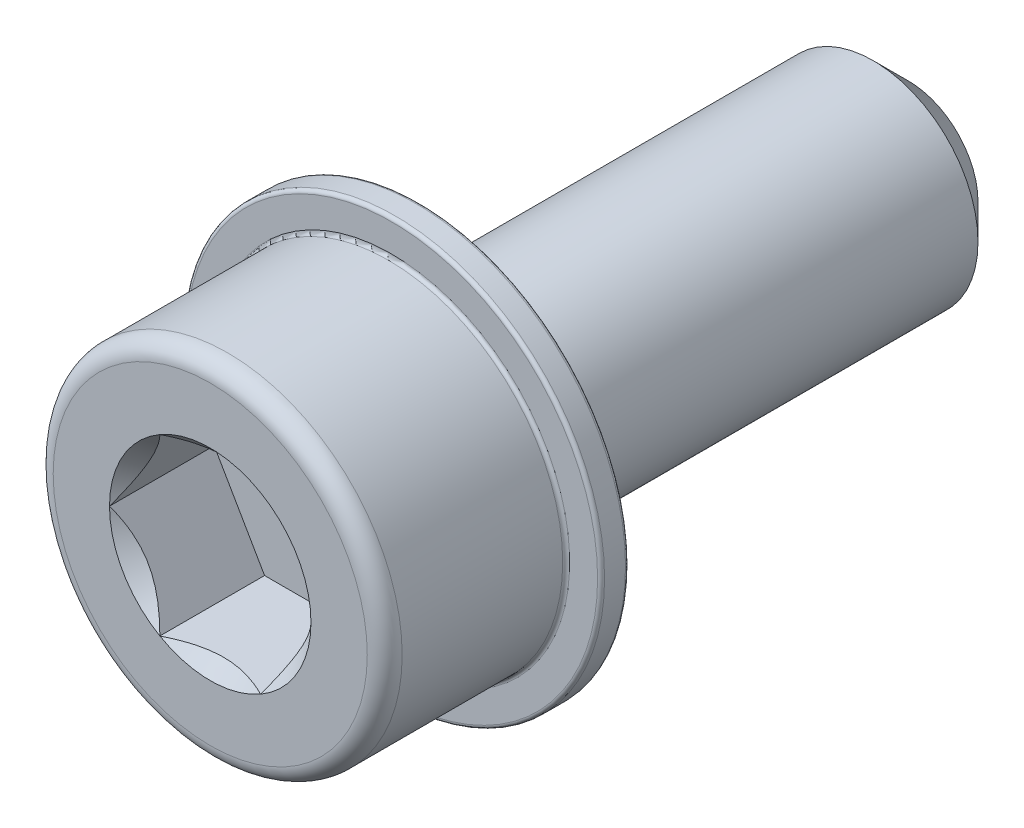
ISO-10303-21;
HEADER;
FILE_DESCRIPTION(('STEP AP214'),'2;1');
FILE_NAME('part.step','',(''),(''),'','','');
FILE_SCHEMA(('AUTOMOTIVE_DESIGN { 1 0 10303 214 1 1 1 1 }'));
ENDSEC;
DATA;
#1=APPLICATION_CONTEXT('core data for automotive mechanical design processes');
#2=APPLICATION_PROTOCOL_DEFINITION('international standard','automotive_design',2000,#1);
#3=PRODUCT_CONTEXT('',#1,'mechanical');
#4=PRODUCT('Part','Part','',(#3));
#5=PRODUCT_RELATED_PRODUCT_CATEGORY('part','',(#4));
#6=PRODUCT_DEFINITION_FORMATION('','',#4);
#7=PRODUCT_DEFINITION_CONTEXT('part definition',#1,'design');
#8=PRODUCT_DEFINITION('design','',#6,#7);
#9=PRODUCT_DEFINITION_SHAPE('','',#8);
#10=(LENGTH_UNIT() NAMED_UNIT(*) SI_UNIT(.MILLI.,.METRE.));
#11=(NAMED_UNIT(*) PLANE_ANGLE_UNIT() SI_UNIT($,.RADIAN.));
#12=(NAMED_UNIT(*) SI_UNIT($,.STERADIAN.) SOLID_ANGLE_UNIT());
#13=UNCERTAINTY_MEASURE_WITH_UNIT(LENGTH_MEASURE(1.E-05),#10,'distance_accuracy_value','');
#14=(GEOMETRIC_REPRESENTATION_CONTEXT(3) GLOBAL_UNCERTAINTY_ASSIGNED_CONTEXT((#13)) GLOBAL_UNIT_ASSIGNED_CONTEXT((#10,
#11,#12)) REPRESENTATION_CONTEXT('',''));
#15=CARTESIAN_POINT('',(0.,0.,0.));
#16=DIRECTION('',(0.,0.,1.));
#17=DIRECTION('',(1.,0.,0.));
#18=AXIS2_PLACEMENT_3D('',#15,#16,#17);
#19=CARTESIAN_POINT('',(0.,0.,20.));
#20=DIRECTION('',(0.,0.,-1.));
#21=DIRECTION('',(-1.,0.,0.));
#22=AXIS2_PLACEMENT_3D('',#19,#20,#21);
#23=CYLINDRICAL_SURFACE('',#22,5.);
#24=CARTESIAN_POINT('',(0.,0.,14.9));
#25=DIRECTION('',(0.,0.,-1.));
#26=DIRECTION('',(-1.,0.,0.));
#27=AXIS2_PLACEMENT_3D('',#24,#25,#26);
#28=CIRCLE('',#27,5.);
#29=CARTESIAN_POINT('',(-5.,0.,14.9));
#30=VERTEX_POINT('',#29);
#31=EDGE_CURVE('E252',#30,#30,#28,.F.);
#32=ORIENTED_EDGE('',*,*,#31,.T.);
#33=EDGE_LOOP('',(#32));
#34=FACE_BOUND('',#33,.T.);
#35=CARTESIAN_POINT('',(0.,0.,19.5));
#36=DIRECTION('',(0.,0.,1.));
#37=DIRECTION('',(1.,0.,0.));
#38=AXIS2_PLACEMENT_3D('',#35,#36,#37);
#39=CIRCLE('',#38,5.);
#40=CARTESIAN_POINT('',(5.,0.,19.5));
#41=VERTEX_POINT('',#40);
#42=EDGE_CURVE('E263',#41,#41,#39,.F.);
#43=ORIENTED_EDGE('',*,*,#42,.T.);
#44=EDGE_LOOP('',(#43));
#45=FACE_BOUND('',#44,.T.);
#46=ADVANCED_FACE('F37',(#34,#45),#23,.T.);
#47=CARTESIAN_POINT('',(0.,0.,20.));
#48=DIRECTION('',(0.,0.,1.));
#49=DIRECTION('',(1.,0.,0.));
#50=AXIS2_PLACEMENT_3D('',#47,#48,#49);
#51=PLANE('',#50);
#52=CARTESIAN_POINT('',(0.,0.,20.));
#53=DIRECTION('',(0.,0.,1.));
#54=DIRECTION('',(1.,0.,0.));
#55=AXIS2_PLACEMENT_3D('',#52,#53,#54);
#56=CIRCLE('',#55,4.5);
#57=CARTESIAN_POINT('',(4.5,0.,20.));
#58=VERTEX_POINT('',#57);
#59=EDGE_CURVE('E110',#58,#58,#56,.T.);
#60=ORIENTED_EDGE('',*,*,#59,.T.);
#61=EDGE_LOOP('',(#60));
#62=FACE_BOUND('',#61,.T.);
#63=CARTESIAN_POINT('',(0.,0.,20.));
#64=DIRECTION('',(0.,0.,1.));
#65=DIRECTION('',(1.,0.,0.));
#66=AXIS2_PLACEMENT_3D('',#63,#64,#65);
#67=CIRCLE('',#66,2.88675134594813);
#68=CARTESIAN_POINT('',(2.88675134594813,0.,20.));
#69=VERTEX_POINT('',#68);
#70=CARTESIAN_POINT('',(1.44337567297406,2.5,20.));
#71=VERTEX_POINT('',#70);
#72=EDGE_CURVE('E91',#69,#71,#67,.T.);
#73=ORIENTED_EDGE('',*,*,#72,.F.);
#74=CARTESIAN_POINT('',(1.44337567297406,-2.5,20.));
#75=VERTEX_POINT('',#74);
#76=EDGE_CURVE('E51',#75,#69,#67,.T.);
#77=ORIENTED_EDGE('',*,*,#76,.F.);
#78=CARTESIAN_POINT('',(-1.44337567297407,-2.5,20.));
#79=VERTEX_POINT('',#78);
#80=EDGE_CURVE('E489',#79,#75,#67,.T.);
#81=ORIENTED_EDGE('',*,*,#80,.F.);
#82=CARTESIAN_POINT('',(-2.88675134594813,0.,20.));
#83=VERTEX_POINT('',#82);
#84=EDGE_CURVE('E58',#83,#79,#67,.T.);
#85=ORIENTED_EDGE('',*,*,#84,.F.);
#86=CARTESIAN_POINT('',(-1.44337567297406,2.5,20.));
#87=VERTEX_POINT('',#86);
#88=EDGE_CURVE('E132',#87,#83,#67,.T.);
#89=ORIENTED_EDGE('',*,*,#88,.F.);
#90=EDGE_CURVE('E100',#71,#87,#67,.T.);
#91=ORIENTED_EDGE('',*,*,#90,.F.);
#92=EDGE_LOOP('',(#73,#77,#81,#85,#89,#91));
#93=FACE_BOUND('',#92,.T.);
#94=ADVANCED_FACE('F131',(#62,#93),#51,.T.);
#95=CARTESIAN_POINT('',(0.,0.,20.));
#96=DIRECTION('',(0.,0.,1.));
#97=DIRECTION('',(1.,0.,0.));
#98=AXIS2_PLACEMENT_3D('',#95,#96,#97);
#99=CONICAL_SURFACE('',#98,2.88675134594813,0.785398163397449);
#100=ORIENTED_EDGE('',*,*,#90,.T.);
#101=CARTESIAN_POINT('',(-2.77020364052284,2.5,20.8447400730379));
#102=CARTESIAN_POINT('',(-2.7022410555542,2.5,20.7942972270805));
#103=CARTESIAN_POINT('',(-2.6338863180949,2.5,20.7443742833945));
#104=CARTESIAN_POINT('',(-2.49624219762247,2.5,20.6457965635655));
#105=CARTESIAN_POINT('',(-2.42695257289823,2.5,20.5971421253073));
#106=CARTESIAN_POINT('',(-2.28678261719515,2.5,20.5009852194684));
#107=CARTESIAN_POINT('',(-2.21589411726428,2.5,20.4534946118865));
#108=CARTESIAN_POINT('',(-2.07289802004975,2.5,20.3603950480203));
#109=CARTESIAN_POINT('',(-2.00079051163237,2.5,20.3147859553995));
#110=CARTESIAN_POINT('',(-1.85136748268391,2.5,20.223534533852));
#111=CARTESIAN_POINT('',(-1.77397645614701,2.5,20.1780144838424));
#112=CARTESIAN_POINT('',(-1.61742302073494,2.5,20.0901374331846));
#113=CARTESIAN_POINT('',(-1.53826031232211,2.5,20.0477809727346));
#114=CARTESIAN_POINT('',(-1.29823189324208,2.5,19.926836843479));
#115=CARTESIAN_POINT('',(-1.13426106122491,2.5,19.8540166137058));
#116=CARTESIAN_POINT('',(-0.887111377423211,2.5,19.7649649600375));
#117=CARTESIAN_POINT('',(-0.807344623847814,2.5,19.7392349869911));
#118=CARTESIAN_POINT('',(-0.64597730320561,2.5,19.6941946828386));
#119=CARTESIAN_POINT('',(-0.564376601152634,2.5,19.6748848259425));
#120=CARTESIAN_POINT('',(-0.401145739824865,2.5,19.6439823848152));
#121=CARTESIAN_POINT('',(-0.319539757140576,2.5,19.6322639530117));
#122=CARTESIAN_POINT('',(-0.155573727460262,2.5,19.6167559106768));
#123=CARTESIAN_POINT('',(-0.0732137924062571,2.5,19.6129651416756));
#124=CARTESIAN_POINT('',(0.0889406015319184,2.5,19.6135562743385));
#125=CARTESIAN_POINT('',(0.168736083218814,2.5,19.6176904853404));
#126=CARTESIAN_POINT('',(0.327588899148971,2.5,19.6333802859842));
#127=CARTESIAN_POINT('',(0.406646157736194,2.5,19.6449366279878));
#128=CARTESIAN_POINT('',(0.564788204196922,2.5,19.6750548405729));
#129=CARTESIAN_POINT('',(0.643850663729501,2.5,19.6937323379977));
#130=CARTESIAN_POINT('',(0.800257176655643,2.5,19.7371330825706));
#131=CARTESIAN_POINT('',(0.877601408561833,2.5,19.7618556984357));
#132=CARTESIAN_POINT('',(1.12635295184178,2.5,19.8505231510706));
#133=CARTESIAN_POINT('',(1.29410071433186,2.5,19.9247783131875));
#134=CARTESIAN_POINT('',(1.53952732574041,2.5,20.0484079316819));
#135=CARTESIAN_POINT('',(1.6204595062186,2.5,20.0917581216177));
#136=CARTESIAN_POINT('',(1.78047620840829,2.5,20.1817519809863));
#137=CARTESIAN_POINT('',(1.8595610677958,2.5,20.2283950421378));
#138=CARTESIAN_POINT('',(2.01217084338596,2.5,20.3218905285226));
#139=CARTESIAN_POINT('',(2.08577537489079,2.5,20.3686144975002));
#140=CARTESIAN_POINT('',(2.23172389872327,2.5,20.4640011850434));
#141=CARTESIAN_POINT('',(2.30406779409797,2.5,20.5126640517881));
#142=CARTESIAN_POINT('',(2.44706675369514,2.5,20.6111718294146));
#143=CARTESIAN_POINT('',(2.51773081098518,2.5,20.6610037396425));
#144=CARTESIAN_POINT('',(2.65809766562528,2.5,20.7619649538652));
#145=CARTESIAN_POINT('',(2.72780072102037,2.5,20.8130938986832));
#146=CARTESIAN_POINT('',(2.79710236410189,2.5,20.8647525705185));
#147=B_SPLINE_CURVE_WITH_KNOTS('',3,(#101,#102,#103,#104,#105,#106,#107,#108,#109,#110,#111,
#112,#113,#114,#115,#116,#117,#118,#119,#120,#121,#122,#123,#124,#125,#126,#127,#128,#129,#130,
#131,#132,#133,#134,#135,#136,#137,#138,#139,#140,#141,#142,#143,#144,#145,#146),.UNSPECIFIED.,
.F.,.F.,(4,2,2,2,2,2,2,2,2,2,2,2,2,2,2,2,2,2,2,2,2,2,4),(0.,0.253915366386489,0.507897689777923,
0.76384969766783,1.01978312631941,1.28906200278226,1.5583867553006,2.09503555889923,
2.34626885307445,2.59752070001156,2.84449292076576,3.09142904893306,3.33077296578897,
3.57014114813028,3.81357397946407,4.05698140030714,4.60559640961545,4.88100918549167,
5.15637121771764,5.41788736617485,5.67942353932132,5.93881038934174,6.19812617721562),.UNSPECIFIED.);
#148=EDGE_CURVE('E105',#71,#87,#147,.F.);
#149=ORIENTED_EDGE('',*,*,#148,.F.);
#150=EDGE_LOOP('',(#100,#149));
#151=FACE_BOUND('',#150,.T.);
#152=ADVANCED_FACE('F106',(#151),#99,.F.);
#153=ORIENTED_EDGE('',*,*,#88,.T.);
#154=CARTESIAN_POINT('',(-1.44326020292023,2.5002,20.0001154769818));
#155=CARTESIAN_POINT('',(-1.49287669073468,2.41426172221224,19.9505407053547));
#156=CARTESIAN_POINT('',(-1.5433228376411,2.32688643272425,19.9038774813625));
#157=CARTESIAN_POINT('',(-1.64618811625259,2.14871854383441,19.8184381400383));
#158=CARTESIAN_POINT('',(-1.69861703122359,2.05790899931893,19.779709562406));
#159=CARTESIAN_POINT('',(-1.80433744175985,1.87479587687308,19.7133667038977));
#160=CARTESIAN_POINT('',(-1.85760201171315,1.78253893547066,19.6855856685309));
#161=CARTESIAN_POINT('',(-1.96530378549009,1.59599399122372,19.6427831759107));
#162=CARTESIAN_POINT('',(-2.01973769896306,1.50171168743372,19.6277297666713));
#163=CARTESIAN_POINT('',(-2.11355131286832,1.33922174170816,19.6141477222095));
#164=CARTESIAN_POINT('',(-2.15280980880341,1.27122403211985,19.6121370992408));
#165=CARTESIAN_POINT('',(-2.23126263056549,1.13533975883078,19.6155241171875));
#166=CARTESIAN_POINT('',(-2.27045692907357,1.06745324244777,19.6209243552998));
#167=CARTESIAN_POINT('',(-2.34847544336504,0.932321211763897,19.6388257884025));
#168=CARTESIAN_POINT('',(-2.38729919566122,0.865076500246443,19.6513349270465));
#169=CARTESIAN_POINT('',(-2.46427534467603,0.731749899181805,19.6827675019557));
#170=CARTESIAN_POINT('',(-2.50242779262541,0.665667920900347,19.7016904464968));
#171=CARTESIAN_POINT('',(-2.60015256308361,0.496403653308738,19.7578673614082));
#172=CARTESIAN_POINT('',(-2.65911894852988,0.394270877777109,19.7993558315962));
#173=CARTESIAN_POINT('',(-2.74582384890657,0.244093585059492,19.8693940467231));
#174=CARTESIAN_POINT('',(-2.77439698586412,0.194603460117391,19.8940022521161));
#175=CARTESIAN_POINT('',(-2.83101398781794,0.0965399361611526,19.9454618867152));
#176=CARTESIAN_POINT('',(-2.85905816495513,0.047965996503071,19.9723119387794));
#177=CARTESIAN_POINT('',(-2.88686681600197,-0.000200000000001453,20.0001154769818));
#178=B_SPLINE_CURVE_WITH_KNOTS('',3,(#154,#155,#156,#157,#158,#159,#160,#161,#162,#163,#164,
#165,#166,#167,#168,#169,#170,#171,#172,#173,#174,#175,#176,#177),.UNSPECIFIED.,.F.,.F.,(4,2,2,
2,2,2,2,2,2,2,2,4),(0.,0.333012085133925,0.667964518301397,0.997597032043299,1.32639954393844,
1.56169424147168,1.79707142102083,2.0327121352217,2.2683347877565,2.64260240809533,
2.82922877818864,3.01574133749025),.UNSPECIFIED.);
#179=EDGE_CURVE('E99',#87,#83,#178,.T.);
#180=ORIENTED_EDGE('',*,*,#179,.F.);
#181=EDGE_LOOP('',(#153,#180));
#182=FACE_BOUND('',#181,.T.);
#183=ADVANCED_FACE('F371',(#182),#99,.F.);
#184=ORIENTED_EDGE('',*,*,#84,.T.);
#185=CARTESIAN_POINT('',(-2.88686681600197,0.000199999999999153,20.0001154769818));
#186=CARTESIAN_POINT('',(-2.83725032818751,-0.0857382777877651,19.9505407053547));
#187=CARTESIAN_POINT('',(-2.7868041812811,-0.173113567275753,19.9038774813625));
#188=CARTESIAN_POINT('',(-2.6839389026696,-0.351281456165588,19.8184381400383));
#189=CARTESIAN_POINT('',(-2.6315099876986,-0.442091000681074,19.779709562406));
#190=CARTESIAN_POINT('',(-2.52578957716234,-0.62520412312692,19.7133667038977));
#191=CARTESIAN_POINT('',(-2.47252500720904,-0.717461064529339,19.6855856685309));
#192=CARTESIAN_POINT('',(-2.3648232334321,-0.904006008776284,19.6427831759107));
#193=CARTESIAN_POINT('',(-2.31038931995913,-0.998288312566281,19.6277297666713));
#194=CARTESIAN_POINT('',(-2.21657570605387,-1.16077825829184,19.6141477222095));
#195=CARTESIAN_POINT('',(-2.17731721011878,-1.22877596788015,19.6121370992408));
#196=CARTESIAN_POINT('',(-2.0988643883567,-1.36466024116922,19.6155241171875));
#197=CARTESIAN_POINT('',(-2.05967008984862,-1.43254675755223,19.6209243552998));
#198=CARTESIAN_POINT('',(-1.98165157555715,-1.5676787882361,19.6388257884025));
#199=CARTESIAN_POINT('',(-1.94282782326097,-1.63492349975356,19.6513349270465));
#200=CARTESIAN_POINT('',(-1.86585167424616,-1.76825010081819,19.6827675019557));
#201=CARTESIAN_POINT('',(-1.82769922629678,-1.83433207909965,19.7016904464968));
#202=CARTESIAN_POINT('',(-1.72997445583858,-2.00359634669126,19.7578673614082));
#203=CARTESIAN_POINT('',(-1.67100807039231,-2.10572912222289,19.7993558315962));
#204=CARTESIAN_POINT('',(-1.58430317001562,-2.25590641494051,19.8693940467231));
#205=CARTESIAN_POINT('',(-1.55573003305807,-2.30539653988261,19.8940022521161));
#206=CARTESIAN_POINT('',(-1.49911303110426,-2.40346006383885,19.9454618867152));
#207=CARTESIAN_POINT('',(-1.47106885396706,-2.45203400349693,19.9723119387794));
#208=CARTESIAN_POINT('',(-1.44326020292023,-2.5002,20.0001154769818));
#209=B_SPLINE_CURVE_WITH_KNOTS('',3,(#185,#186,#187,#188,#189,#190,#191,#192,#193,#194,#195,
#196,#197,#198,#199,#200,#201,#202,#203,#204,#205,#206,#207,#208),.UNSPECIFIED.,.F.,.F.,(4,2,2,
2,2,2,2,2,2,2,2,4),(0.,0.333012085133924,0.667964518301397,0.997597032043297,1.32639954393844,
1.56169424147168,1.79707142102082,2.0327121352217,2.2683347877565,2.64260240809533,
2.82922877818864,3.01574133749025),.UNSPECIFIED.);
#210=EDGE_CURVE('E142',#83,#79,#209,.T.);
#211=ORIENTED_EDGE('',*,*,#210,.F.);
#212=EDGE_LOOP('',(#184,#211));
#213=FACE_BOUND('',#212,.T.);
#214=ADVANCED_FACE('F363',(#213),#99,.F.);
#215=ORIENTED_EDGE('',*,*,#80,.T.);
#216=CARTESIAN_POINT('',(-2.77020363749965,-2.5,20.8447400707935));
#217=CARTESIAN_POINT('',(-2.70224105261352,-2.5,20.7942972249221));
#218=CARTESIAN_POINT('',(-2.63388631523702,-2.5,20.744374281322));
#219=CARTESIAN_POINT('',(-2.49624219493107,-2.5,20.6457965616641));
#220=CARTESIAN_POINT('',(-2.4269525702905,-2.5,20.5971421234912));
#221=CARTESIAN_POINT('',(-2.28678261475764,-2.5,20.5009852178235));
#222=CARTESIAN_POINT('',(-2.21589411491334,-2.5,20.4534946103276));
#223=CARTESIAN_POINT('',(-2.07289801787356,-2.5,20.3603950466318));
#224=CARTESIAN_POINT('',(-2.00079050954437,-2.5,20.3147859540954));
#225=CARTESIAN_POINT('',(-1.85136748078596,-2.5,20.2235345327233));
#226=CARTESIAN_POINT('',(-1.77397645435118,-2.5,20.1780144828043));
#227=CARTESIAN_POINT('',(-1.61742301914699,-2.5,20.0901374323232));
#228=CARTESIAN_POINT('',(-1.53826031083992,-2.5,20.0477809719594));
#229=CARTESIAN_POINT('',(-1.29823189208257,-2.5,19.9268368429515));
#230=CARTESIAN_POINT('',(-1.1342610602898,-2.5,19.8540166133308));
#231=CARTESIAN_POINT('',(-0.887111376658194,-2.5,19.7649649597796));
#232=CARTESIAN_POINT('',(-0.807344623014012,-2.5,19.7392349867326));
#233=CARTESIAN_POINT('',(-0.645977302232371,-2.5,19.6941946825928));
#234=CARTESIAN_POINT('',(-0.564376600108744,-2.5,19.6748848257101));
#235=CARTESIAN_POINT('',(-0.401145738642201,-2.5,19.6439823846255));
#236=CARTESIAN_POINT('',(-0.319539755889808,-2.5,19.6322639528508));
#237=CARTESIAN_POINT('',(-0.155573726076,-2.5,19.6167559105885));
#238=CARTESIAN_POINT('',(-0.0732137909566043,-2.5,19.6129651416311));
#239=CARTESIAN_POINT('',(0.0889406031113426,-2.5,19.6135562743926));
#240=CARTESIAN_POINT('',(0.168736084862771,-2.5,19.6176904854494));
#241=CARTESIAN_POINT('',(0.327588900916057,-2.5,19.6333802862122));
#242=CARTESIAN_POINT('',(0.406646159561878,-2.5,19.6449366282797));
#243=CARTESIAN_POINT('',(0.564788206138293,-2.5,19.6750548409995));
#244=CARTESIAN_POINT('',(0.643850665727805,-2.5,19.6937323384953));
#245=CARTESIAN_POINT('',(0.800257178762726,-2.5,19.7371330832123));
#246=CARTESIAN_POINT('',(0.877601410720764,-2.5,19.7618556991505));
#247=CARTESIAN_POINT('',(1.12635295448186,-2.5,19.8505231521358));
#248=CARTESIAN_POINT('',(1.29410071737717,-2.5,19.9247783145763));
#249=CARTESIAN_POINT('',(1.53952732936915,-2.5,20.0484079335823));
#250=CARTESIAN_POINT('',(1.62045951003841,-2.5,20.0917581236935));
#251=CARTESIAN_POINT('',(1.78047621260416,-2.5,20.1817519834187));
#252=CARTESIAN_POINT('',(1.85956107217667,-2.5,20.2283950447511));
#253=CARTESIAN_POINT('',(2.01217084810339,-2.5,20.3218905314796));
#254=CARTESIAN_POINT('',(2.0857753797604,-2.5,20.3686145006192));
#255=CARTESIAN_POINT('',(2.23172390389513,-2.5,20.4640011884871));
#256=CARTESIAN_POINT('',(2.3040677994199,-2.5,20.5126640553945));
#257=CARTESIAN_POINT('',(2.44706675931361,-2.5,20.6111718333444));
#258=CARTESIAN_POINT('',(2.51773081675014,-2.5,20.6610037437331));
#259=CARTESIAN_POINT('',(2.6580976716823,-2.5,20.7619649582772));
#260=CARTESIAN_POINT('',(2.72780072722295,-2.5,20.8130939032558));
#261=CARTESIAN_POINT('',(2.7971023704498,-2.5,20.8647525752515));
#262=B_SPLINE_CURVE_WITH_KNOTS('',3,(#216,#217,#218,#219,#220,#221,#222,#223,#224,#225,#226,
#227,#228,#229,#230,#231,#232,#233,#234,#235,#236,#237,#238,#239,#240,#241,#242,#243,#244,#245,
#246,#247,#248,#249,#250,#251,#252,#253,#254,#255,#256,#257,#258,#259,#260,#261),.UNSPECIFIED.,
.F.,.F.,(4,2,2,2,2,2,2,2,2,2,2,2,2,2,2,2,2,2,2,2,2,2,4),(0.,0.253915366034017,0.50789768907288,
0.763849696603627,1.0197831248961,1.28906200095732,1.55838675307382,2.09503555587664,
2.34626885024813,2.59752069738117,2.84449291832419,3.09142904668035,3.33077296373735,
3.57014114627994,3.81357397782878,4.0569813988868,4.60559640969274,4.88100918632302,
5.15637121930271,5.41788736840582,5.67942354219824,5.93881039285584,6.19812618136684),.UNSPECIFIED.);
#263=EDGE_CURVE('E172',#79,#75,#262,.T.);
#264=ORIENTED_EDGE('',*,*,#263,.F.);
#265=EDGE_LOOP('',(#215,#264));
#266=FACE_BOUND('',#265,.T.);
#267=ADVANCED_FACE('F356',(#266),#99,.F.);
#268=ORIENTED_EDGE('',*,*,#76,.T.);
#269=CARTESIAN_POINT('',(1.44326020292023,-2.5002,20.0001154769818));
#270=CARTESIAN_POINT('',(1.49287669073468,-2.41426172221224,19.9505407053547));
#271=CARTESIAN_POINT('',(1.5433228376411,-2.32688643272425,19.9038774813625));
#272=CARTESIAN_POINT('',(1.64618811625259,-2.14871854383441,19.8184381400383));
#273=CARTESIAN_POINT('',(1.69861703122359,-2.05790899931893,19.779709562406));
#274=CARTESIAN_POINT('',(1.80433744175985,-1.87479587687308,19.7133667038977));
#275=CARTESIAN_POINT('',(1.85760201171315,-1.78253893547066,19.6855856685309));
#276=CARTESIAN_POINT('',(1.96530378549009,-1.59599399122372,19.6427831759107));
#277=CARTESIAN_POINT('',(2.01973769896306,-1.50171168743372,19.6277297666713));
#278=CARTESIAN_POINT('',(2.11355131286832,-1.33922174170816,19.6141477222095));
#279=CARTESIAN_POINT('',(2.15280980880341,-1.27122403211985,19.6121370992408));
#280=CARTESIAN_POINT('',(2.23126263056549,-1.13533975883078,19.6155241171875));
#281=CARTESIAN_POINT('',(2.27045692907357,-1.06745324244777,19.6209243552998));
#282=CARTESIAN_POINT('',(2.34847544336504,-0.932321211763898,19.6388257884025));
#283=CARTESIAN_POINT('',(2.38729919566123,-0.865076500246444,19.6513349270465));
#284=CARTESIAN_POINT('',(2.46427534467603,-0.731749899181805,19.6827675019557));
#285=CARTESIAN_POINT('',(2.50242779262541,-0.665667920900347,19.7016904464968));
#286=CARTESIAN_POINT('',(2.60015256308361,-0.496403653308739,19.7578673614082));
#287=CARTESIAN_POINT('',(2.65911894852988,-0.39427087777711,19.7993558315962));
#288=CARTESIAN_POINT('',(2.74582384890657,-0.244093585059492,19.8693940467231));
#289=CARTESIAN_POINT('',(2.77439698586412,-0.194603460117391,19.8940022521161));
#290=CARTESIAN_POINT('',(2.83101398781794,-0.0965399361611533,19.9454618867152));
#291=CARTESIAN_POINT('',(2.85905816495513,-0.0479659965030719,19.9723119387794));
#292=CARTESIAN_POINT('',(2.88686681600197,0.000200000000000732,20.0001154769818));
#293=B_SPLINE_CURVE_WITH_KNOTS('',3,(#269,#270,#271,#272,#273,#274,#275,#276,#277,#278,#279,
#280,#281,#282,#283,#284,#285,#286,#287,#288,#289,#290,#291,#292),.UNSPECIFIED.,.F.,.F.,(4,2,2,
2,2,2,2,2,2,2,2,4),(0.,0.333012085133924,0.667964518301398,0.997597032043299,1.32639954393844,
1.56169424147168,1.79707142102083,2.0327121352217,2.2683347877565,2.64260240809533,
2.82922877818864,3.01574133749025),.UNSPECIFIED.);
#294=EDGE_CURVE('E121',#75,#69,#293,.T.);
#295=ORIENTED_EDGE('',*,*,#294,.F.);
#296=EDGE_LOOP('',(#268,#295));
#297=FACE_BOUND('',#296,.T.);
#298=ADVANCED_FACE('F157',(#297),#99,.F.);
#299=ORIENTED_EDGE('',*,*,#72,.T.);
#300=CARTESIAN_POINT('',(2.88686681600197,-0.000199999999999798,20.0001154769818));
#301=CARTESIAN_POINT('',(2.83725032818751,0.0857382777877648,19.9505407053547));
#302=CARTESIAN_POINT('',(2.7868041812811,0.173113567275753,19.9038774813625));
#303=CARTESIAN_POINT('',(2.6839389026696,0.351281456165588,19.8184381400383));
#304=CARTESIAN_POINT('',(2.6315099876986,0.442091000681074,19.779709562406));
#305=CARTESIAN_POINT('',(2.52578957716234,0.62520412312692,19.7133667038977));
#306=CARTESIAN_POINT('',(2.47252500720904,0.71746106452934,19.6855856685309));
#307=CARTESIAN_POINT('',(2.3648232334321,0.904006008776285,19.6427831759107));
#308=CARTESIAN_POINT('',(2.31038931995913,0.998288312566282,19.6277297666713));
#309=CARTESIAN_POINT('',(2.21657570605387,1.16077825829184,19.6141477222095));
#310=CARTESIAN_POINT('',(2.17731721011878,1.22877596788015,19.6121370992408));
#311=CARTESIAN_POINT('',(2.0988643883567,1.36466024116922,19.6155241171875));
#312=CARTESIAN_POINT('',(2.05967008984862,1.43254675755223,19.6209243552998));
#313=CARTESIAN_POINT('',(1.98165157555715,1.5676787882361,19.6388257884025));
#314=CARTESIAN_POINT('',(1.94282782326097,1.63492349975356,19.6513349270465));
#315=CARTESIAN_POINT('',(1.86585167424616,1.7682501008182,19.6827675019557));
#316=CARTESIAN_POINT('',(1.82769922629678,1.83433207909965,19.7016904464968));
#317=CARTESIAN_POINT('',(1.72997445583858,2.00359634669126,19.7578673614082));
#318=CARTESIAN_POINT('',(1.67100807039231,2.10572912222289,19.7993558315962));
#319=CARTESIAN_POINT('',(1.58430317001562,2.25590641494051,19.8693940467231));
#320=CARTESIAN_POINT('',(1.55573003305807,2.30539653988261,19.8940022521161));
#321=CARTESIAN_POINT('',(1.49911303110425,2.40346006383885,19.9454618867152));
#322=CARTESIAN_POINT('',(1.47106885396706,2.45203400349693,19.9723119387794));
#323=CARTESIAN_POINT('',(1.44326020292023,2.5002,20.0001154769818));
#324=B_SPLINE_CURVE_WITH_KNOTS('',3,(#300,#301,#302,#303,#304,#305,#306,#307,#308,#309,#310,
#311,#312,#313,#314,#315,#316,#317,#318,#319,#320,#321,#322,#323),.UNSPECIFIED.,.F.,.F.,(4,2,2,
2,2,2,2,2,2,2,2,4),(0.,0.333012085133925,0.667964518301397,0.997597032043299,1.32639954393844,
1.56169424147168,1.79707142102082,2.0327121352217,2.2683347877565,2.64260240809533,
2.82922877818864,3.01574133749025),.UNSPECIFIED.);
#325=EDGE_CURVE('E95',#69,#71,#324,.T.);
#326=ORIENTED_EDGE('',*,*,#325,.F.);
#327=EDGE_LOOP('',(#299,#326));
#328=FACE_BOUND('',#327,.T.);
#329=ADVANCED_FACE('F93',(#328),#99,.F.);
#330=CARTESIAN_POINT('',(0.,0.,17.));
#331=DIRECTION('',(0.,0.,1.));
#332=DIRECTION('',(1.,0.,0.));
#333=AXIS2_PLACEMENT_3D('',#330,#331,#332);
#334=PLANE('',#333);
#335=DIRECTION('',(-0.5,0.866025403784439,0.));
#336=VECTOR('',#335,1.);
#337=CARTESIAN_POINT('',(2.88675134594813,0.,17.));
#338=LINE('',#337,#336);
#339=CARTESIAN_POINT('',(2.88675134594813,0.,17.));
#340=VERTEX_POINT('',#339);
#341=CARTESIAN_POINT('',(1.44337567297406,2.5,17.));
#342=VERTEX_POINT('',#341);
#343=EDGE_CURVE('E120',#340,#342,#338,.T.);
#344=ORIENTED_EDGE('',*,*,#343,.T.);
#345=DIRECTION('',(-1.,0.,0.));
#346=VECTOR('',#345,1.);
#347=CARTESIAN_POINT('',(1.44337567297406,2.5,17.));
#348=LINE('',#347,#346);
#349=CARTESIAN_POINT('',(-1.44337567297406,2.5,17.));
#350=VERTEX_POINT('',#349);
#351=EDGE_CURVE('E125',#342,#350,#348,.T.);
#352=ORIENTED_EDGE('',*,*,#351,.T.);
#353=DIRECTION('',(-0.5,-0.866025403784439,0.));
#354=VECTOR('',#353,1.);
#355=CARTESIAN_POINT('',(-1.44337567297406,2.5,17.));
#356=LINE('',#355,#354);
#357=CARTESIAN_POINT('',(-2.88675134594813,0.,17.));
#358=VERTEX_POINT('',#357);
#359=EDGE_CURVE('E451',#350,#358,#356,.T.);
#360=ORIENTED_EDGE('',*,*,#359,.T.);
#361=DIRECTION('',(0.5,-0.866025403784439,0.));
#362=VECTOR('',#361,1.);
#363=CARTESIAN_POINT('',(-2.88675134594813,0.,17.));
#364=LINE('',#363,#362);
#365=CARTESIAN_POINT('',(-1.44337567297406,-2.5,17.));
#366=VERTEX_POINT('',#365);
#367=EDGE_CURVE('E455',#358,#366,#364,.T.);
#368=ORIENTED_EDGE('',*,*,#367,.T.);
#369=DIRECTION('',(1.,0.,0.));
#370=VECTOR('',#369,1.);
#371=CARTESIAN_POINT('',(-1.44337567297406,-2.5,17.));
#372=LINE('',#371,#370);
#373=CARTESIAN_POINT('',(1.44337567297406,-2.5,17.));
#374=VERTEX_POINT('',#373);
#375=EDGE_CURVE('E458',#366,#374,#372,.T.);
#376=ORIENTED_EDGE('',*,*,#375,.T.);
#377=DIRECTION('',(0.5,0.866025403784439,0.));
#378=VECTOR('',#377,1.);
#379=CARTESIAN_POINT('',(1.44337567297406,-2.5,17.));
#380=LINE('',#379,#378);
#381=EDGE_CURVE('E128',#374,#340,#380,.T.);
#382=ORIENTED_EDGE('',*,*,#381,.T.);
#383=EDGE_LOOP('',(#344,#352,#360,#368,#376,#382));
#384=FACE_BOUND('',#383,.T.);
#385=ADVANCED_FACE('F156',(#384),#334,.T.);
#386=CARTESIAN_POINT('',(1.44337567297406,2.5,17.));
#387=DIRECTION('',(0.,1.,0.));
#388=DIRECTION('',(-1.,0.,0.));
#389=AXIS2_PLACEMENT_3D('',#386,#387,#388);
#390=PLANE('',#389);
#391=DIRECTION('',(0.,0.,1.));
#392=VECTOR('',#391,1.);
#393=CARTESIAN_POINT('',(1.44337567297406,2.5,17.));
#394=LINE('',#393,#392);
#395=EDGE_CURVE('E117',#342,#71,#394,.T.);
#396=ORIENTED_EDGE('',*,*,#395,.T.);
#397=ORIENTED_EDGE('',*,*,#148,.T.);
#398=DIRECTION('',(0.,0.,1.));
#399=VECTOR('',#398,1.);
#400=CARTESIAN_POINT('',(-1.44337567297406,2.5,17.));
#401=LINE('',#400,#399);
#402=EDGE_CURVE('E127',#350,#87,#401,.T.);
#403=ORIENTED_EDGE('',*,*,#402,.F.);
#404=ORIENTED_EDGE('',*,*,#351,.F.);
#405=EDGE_LOOP('',(#396,#397,#403,#404));
#406=FACE_BOUND('',#405,.T.);
#407=ADVANCED_FACE('F123',(#406),#390,.F.);
#408=CARTESIAN_POINT('',(-1.44337567297406,2.5,17.));
#409=DIRECTION('',(-0.866025403784439,0.5,0.));
#410=DIRECTION('',(-0.5,-0.866025403784439,0.));
#411=AXIS2_PLACEMENT_3D('',#408,#409,#410);
#412=PLANE('',#411);
#413=ORIENTED_EDGE('',*,*,#402,.T.);
#414=ORIENTED_EDGE('',*,*,#179,.T.);
#415=DIRECTION('',(0.,0.,1.));
#416=VECTOR('',#415,1.);
#417=CARTESIAN_POINT('',(-2.88675134594813,0.,17.));
#418=LINE('',#417,#416);
#419=EDGE_CURVE('E468',#358,#83,#418,.T.);
#420=ORIENTED_EDGE('',*,*,#419,.F.);
#421=ORIENTED_EDGE('',*,*,#359,.F.);
#422=EDGE_LOOP('',(#413,#414,#420,#421));
#423=FACE_BOUND('',#422,.T.);
#424=ADVANCED_FACE('F149',(#423),#412,.F.);
#425=CARTESIAN_POINT('',(-2.88675134594813,0.,17.));
#426=DIRECTION('',(-0.866025403784439,-0.5,0.));
#427=DIRECTION('',(0.5,-0.866025403784439,0.));
#428=AXIS2_PLACEMENT_3D('',#425,#426,#427);
#429=PLANE('',#428);
#430=ORIENTED_EDGE('',*,*,#419,.T.);
#431=ORIENTED_EDGE('',*,*,#210,.T.);
#432=DIRECTION('',(0.,0.,1.));
#433=VECTOR('',#432,1.);
#434=CARTESIAN_POINT('',(-1.44337567297406,-2.5,17.));
#435=LINE('',#434,#433);
#436=EDGE_CURVE('E465',#366,#79,#435,.T.);
#437=ORIENTED_EDGE('',*,*,#436,.F.);
#438=ORIENTED_EDGE('',*,*,#367,.F.);
#439=EDGE_LOOP('',(#430,#431,#437,#438));
#440=FACE_BOUND('',#439,.T.);
#441=ADVANCED_FACE('F196',(#440),#429,.F.);
#442=CARTESIAN_POINT('',(-1.44337567297406,-2.5,17.));
#443=DIRECTION('',(0.,-1.,0.));
#444=DIRECTION('',(1.,0.,0.));
#445=AXIS2_PLACEMENT_3D('',#442,#443,#444);
#446=PLANE('',#445);
#447=ORIENTED_EDGE('',*,*,#436,.T.);
#448=ORIENTED_EDGE('',*,*,#263,.T.);
#449=DIRECTION('',(0.,0.,1.));
#450=VECTOR('',#449,1.);
#451=CARTESIAN_POINT('',(1.44337567297406,-2.5,17.));
#452=LINE('',#451,#450);
#453=EDGE_CURVE('E463',#374,#75,#452,.T.);
#454=ORIENTED_EDGE('',*,*,#453,.F.);
#455=ORIENTED_EDGE('',*,*,#375,.F.);
#456=EDGE_LOOP('',(#447,#448,#454,#455));
#457=FACE_BOUND('',#456,.T.);
#458=ADVANCED_FACE('F192',(#457),#446,.F.);
#459=CARTESIAN_POINT('',(1.44337567297406,-2.5,17.));
#460=DIRECTION('',(0.866025403784439,-0.5,0.));
#461=DIRECTION('',(0.5,0.866025403784439,0.));
#462=AXIS2_PLACEMENT_3D('',#459,#460,#461);
#463=PLANE('',#462);
#464=ORIENTED_EDGE('',*,*,#453,.T.);
#465=ORIENTED_EDGE('',*,*,#294,.T.);
#466=DIRECTION('',(0.,0.,1.));
#467=VECTOR('',#466,1.);
#468=CARTESIAN_POINT('',(2.88675134594813,0.,17.));
#469=LINE('',#468,#467);
#470=EDGE_CURVE('E119',#340,#69,#469,.T.);
#471=ORIENTED_EDGE('',*,*,#470,.F.);
#472=ORIENTED_EDGE('',*,*,#381,.F.);
#473=EDGE_LOOP('',(#464,#465,#471,#472));
#474=FACE_BOUND('',#473,.T.);
#475=ADVANCED_FACE('F189',(#474),#463,.F.);
#476=CARTESIAN_POINT('',(2.88675134594813,0.,17.));
#477=DIRECTION('',(0.866025403784438,0.5,0.));
#478=DIRECTION('',(-0.5,0.866025403784439,0.));
#479=AXIS2_PLACEMENT_3D('',#476,#477,#478);
#480=PLANE('',#479);
#481=ORIENTED_EDGE('',*,*,#470,.T.);
#482=ORIENTED_EDGE('',*,*,#325,.T.);
#483=ORIENTED_EDGE('',*,*,#395,.F.);
#484=ORIENTED_EDGE('',*,*,#343,.F.);
#485=EDGE_LOOP('',(#481,#482,#483,#484));
#486=FACE_BOUND('',#485,.T.);
#487=ADVANCED_FACE('F115',(#486),#480,.F.);
#488=CARTESIAN_POINT('',(0.,0.,19.5));
#489=DIRECTION('',(0.,0.,1.));
#490=DIRECTION('',(1.,0.,0.));
#491=AXIS2_PLACEMENT_3D('',#488,#489,#490);
#492=TOROIDAL_SURFACE('',#491,4.5,0.5);
#493=ORIENTED_EDGE('',*,*,#42,.F.);
#494=EDGE_LOOP('',(#493));
#495=FACE_BOUND('',#494,.T.);
#496=ORIENTED_EDGE('',*,*,#59,.F.);
#497=EDGE_LOOP('',(#496));
#498=FACE_BOUND('',#497,.T.);
#499=ADVANCED_FACE('F232',(#495,#498),#492,.T.);
#500=CARTESIAN_POINT('',(0.,0.,14.8));
#501=DIRECTION('',(0.,0.,-1.));
#502=DIRECTION('',(-1.,0.,0.));
#503=AXIS2_PLACEMENT_3D('',#500,#501,#502);
#504=CYLINDRICAL_SURFACE('',#503,6.);
#505=CARTESIAN_POINT('',(0.,0.,14.1));
#506=DIRECTION('',(0.,0.,1.));
#507=DIRECTION('',(1.,0.,0.));
#508=AXIS2_PLACEMENT_3D('',#505,#506,#507);
#509=CIRCLE('',#508,6.);
#510=CARTESIAN_POINT('',(6.,0.,14.1));
#511=VERTEX_POINT('',#510);
#512=EDGE_CURVE('E11',#511,#511,#509,.T.);
#513=ORIENTED_EDGE('',*,*,#512,.T.);
#514=EDGE_LOOP('',(#513));
#515=FACE_BOUND('',#514,.T.);
#516=CARTESIAN_POINT('',(0.,0.,14.7));
#517=DIRECTION('',(0.,0.,-1.));
#518=DIRECTION('',(-1.,0.,0.));
#519=AXIS2_PLACEMENT_3D('',#516,#517,#518);
#520=CIRCLE('',#519,6.);
#521=CARTESIAN_POINT('',(-6.,0.,14.7));
#522=VERTEX_POINT('',#521);
#523=EDGE_CURVE('E45',#522,#522,#520,.T.);
#524=ORIENTED_EDGE('',*,*,#523,.T.);
#525=EDGE_LOOP('',(#524));
#526=FACE_BOUND('',#525,.T.);
#527=ADVANCED_FACE('F158',(#515,#526),#504,.T.);
#528=CARTESIAN_POINT('',(0.,0.,14.8));
#529=DIRECTION('',(0.,0.,-1.));
#530=DIRECTION('',(-1.,0.,0.));
#531=AXIS2_PLACEMENT_3D('',#528,#529,#530);
#532=PLANE('',#531);
#533=CARTESIAN_POINT('',(0.,0.,14.8));
#534=DIRECTION('',(0.,0.,-1.));
#535=DIRECTION('',(-1.,0.,0.));
#536=AXIS2_PLACEMENT_3D('',#533,#534,#535);
#537=CIRCLE('',#536,5.1);
#538=CARTESIAN_POINT('',(-5.1,0.,14.8));
#539=VERTEX_POINT('',#538);
#540=EDGE_CURVE('E255',#539,#539,#537,.T.);
#541=ORIENTED_EDGE('',*,*,#540,.T.);
#542=EDGE_LOOP('',(#541));
#543=FACE_BOUND('',#542,.T.);
#544=CARTESIAN_POINT('',(0.,0.,14.8));
#545=DIRECTION('',(0.,0.,-1.));
#546=DIRECTION('',(-1.,0.,0.));
#547=AXIS2_PLACEMENT_3D('',#544,#545,#546);
#548=CIRCLE('',#547,5.9);
#549=CARTESIAN_POINT('',(-5.9,0.,14.8));
#550=VERTEX_POINT('',#549);
#551=EDGE_CURVE('E260',#550,#550,#548,.F.);
#552=ORIENTED_EDGE('',*,*,#551,.T.);
#553=EDGE_LOOP('',(#552));
#554=FACE_BOUND('',#553,.T.);
#555=ADVANCED_FACE('F223',(#543,#554),#532,.F.);
#556=CARTESIAN_POINT('',(0.,0.,0.));
#557=DIRECTION('',(0.,0.,1.));
#558=DIRECTION('',(1.,0.,0.));
#559=AXIS2_PLACEMENT_3D('',#556,#557,#558);
#560=PLANE('',#559);
#561=CARTESIAN_POINT('',(0.,0.,0.));
#562=DIRECTION('',(0.,0.,1.));
#563=DIRECTION('',(1.,0.,0.));
#564=AXIS2_PLACEMENT_3D('',#561,#562,#563);
#565=CIRCLE('',#564,2.);
#566=CARTESIAN_POINT('',(2.,0.,0.));
#567=VERTEX_POINT('',#566);
#568=EDGE_CURVE('E111',#567,#567,#565,.F.);
#569=ORIENTED_EDGE('',*,*,#568,.T.);
#570=EDGE_LOOP('',(#569));
#571=FACE_BOUND('',#570,.T.);
#572=ADVANCED_FACE('F219',(#571),#560,.F.);
#573=CARTESIAN_POINT('',(0.,0.,0.999999999999996));
#574=DIRECTION('',(0.,0.,1.));
#575=DIRECTION('',(1.,0.,0.));
#576=AXIS2_PLACEMENT_3D('',#573,#574,#575);
#577=CONICAL_SURFACE('',#576,3.,0.78539816339745);
#578=ORIENTED_EDGE('',*,*,#568,.F.);
#579=EDGE_LOOP('',(#578));
#580=FACE_BOUND('',#579,.T.);
#581=CARTESIAN_POINT('',(0.,0.,0.999999999999996));
#582=DIRECTION('',(0.,0.,1.));
#583=DIRECTION('',(1.,0.,0.));
#584=AXIS2_PLACEMENT_3D('',#581,#582,#583);
#585=CIRCLE('',#584,3.);
#586=CARTESIAN_POINT('',(3.,0.,0.999999999999996));
#587=VERTEX_POINT('',#586);
#588=EDGE_CURVE('E473',#587,#587,#585,.T.);
#589=ORIENTED_EDGE('',*,*,#588,.F.);
#590=EDGE_LOOP('',(#589));
#591=FACE_BOUND('',#590,.T.);
#592=ADVANCED_FACE('F222',(#580,#591),#577,.T.);
#593=CARTESIAN_POINT('',(0.,0.,14.));
#594=DIRECTION('',(0.,0.,-1.));
#595=DIRECTION('',(-1.,0.,0.));
#596=AXIS2_PLACEMENT_3D('',#593,#594,#595);
#597=CYLINDRICAL_SURFACE('',#596,3.);
#598=ORIENTED_EDGE('',*,*,#588,.T.);
#599=EDGE_LOOP('',(#598));
#600=FACE_BOUND('',#599,.T.);
#601=CARTESIAN_POINT('',(0.,0.,14.));
#602=DIRECTION('',(0.,0.,1.));
#603=DIRECTION('',(1.,0.,0.));
#604=AXIS2_PLACEMENT_3D('',#601,#602,#603);
#605=CIRCLE('',#604,3.);
#606=CARTESIAN_POINT('',(3.,0.,14.));
#607=VERTEX_POINT('',#606);
#608=EDGE_CURVE('E462',#607,#607,#605,.T.);
#609=ORIENTED_EDGE('',*,*,#608,.F.);
#610=EDGE_LOOP('',(#609));
#611=FACE_BOUND('',#610,.T.);
#612=ADVANCED_FACE('F225',(#600,#611),#597,.T.);
#613=CARTESIAN_POINT('',(0.,0.,14.));
#614=DIRECTION('',(0.,0.,1.));
#615=DIRECTION('',(1.,0.,0.));
#616=AXIS2_PLACEMENT_3D('',#613,#614,#615);
#617=PLANE('',#616);
#618=CARTESIAN_POINT('',(0.,0.,14.));
#619=DIRECTION('',(0.,0.,1.));
#620=DIRECTION('',(1.,0.,0.));
#621=AXIS2_PLACEMENT_3D('',#618,#619,#620);
#622=CIRCLE('',#621,5.9);
#623=CARTESIAN_POINT('',(5.9,0.,14.));
#624=VERTEX_POINT('',#623);
#625=EDGE_CURVE('E250',#624,#624,#622,.F.);
#626=ORIENTED_EDGE('',*,*,#625,.T.);
#627=EDGE_LOOP('',(#626));
#628=FACE_BOUND('',#627,.T.);
#629=ORIENTED_EDGE('',*,*,#608,.T.);
#630=EDGE_LOOP('',(#629));
#631=FACE_BOUND('',#630,.T.);
#632=ADVANCED_FACE('F218',(#628,#631),#617,.F.);
#633=CARTESIAN_POINT('',(0.,0.,14.9));
#634=DIRECTION('',(0.,0.,-1.));
#635=DIRECTION('',(-1.,0.,0.));
#636=AXIS2_PLACEMENT_3D('',#633,#634,#635);
#637=TOROIDAL_SURFACE('',#636,5.1,0.1);
#638=ORIENTED_EDGE('',*,*,#31,.F.);
#639=EDGE_LOOP('',(#638));
#640=FACE_BOUND('',#639,.T.);
#641=ORIENTED_EDGE('',*,*,#540,.F.);
#642=EDGE_LOOP('',(#641));
#643=FACE_BOUND('',#642,.T.);
#644=ADVANCED_FACE('F236',(#640,#643),#637,.F.);
#645=CARTESIAN_POINT('',(0.,0.,14.1));
#646=DIRECTION('',(0.,0.,1.));
#647=DIRECTION('',(1.,0.,0.));
#648=AXIS2_PLACEMENT_3D('',#645,#646,#647);
#649=TOROIDAL_SURFACE('',#648,5.9,0.1);
#650=ORIENTED_EDGE('',*,*,#512,.F.);
#651=EDGE_LOOP('',(#650));
#652=FACE_BOUND('',#651,.T.);
#653=ORIENTED_EDGE('',*,*,#625,.F.);
#654=EDGE_LOOP('',(#653));
#655=FACE_BOUND('',#654,.T.);
#656=ADVANCED_FACE('F238',(#652,#655),#649,.T.);
#657=CARTESIAN_POINT('',(0.,0.,14.7));
#658=DIRECTION('',(0.,0.,-1.));
#659=DIRECTION('',(-1.,0.,0.));
#660=AXIS2_PLACEMENT_3D('',#657,#658,#659);
#661=TOROIDAL_SURFACE('',#660,5.9,0.1);
#662=ORIENTED_EDGE('',*,*,#551,.F.);
#663=EDGE_LOOP('',(#662));
#664=FACE_BOUND('',#663,.T.);
#665=ORIENTED_EDGE('',*,*,#523,.F.);
#666=EDGE_LOOP('',(#665));
#667=FACE_BOUND('',#666,.T.);
#668=ADVANCED_FACE('F39',(#664,#667),#661,.T.);
#669=CLOSED_SHELL('',(#46,#94,#152,#183,#214,#267,#298,#329,#385,#407,#424,#441,#458,#475,#487,
#499,#527,#555,#572,#592,#612,#632,#644,#656,#668));
#670=MANIFOLD_SOLID_BREP('B2',#669);
#671=ADVANCED_BREP_SHAPE_REPRESENTATION('',(#18,#670),#14);
#672=SHAPE_DEFINITION_REPRESENTATION(#9,#671);
ENDSEC;
END-ISO-10303-21;
